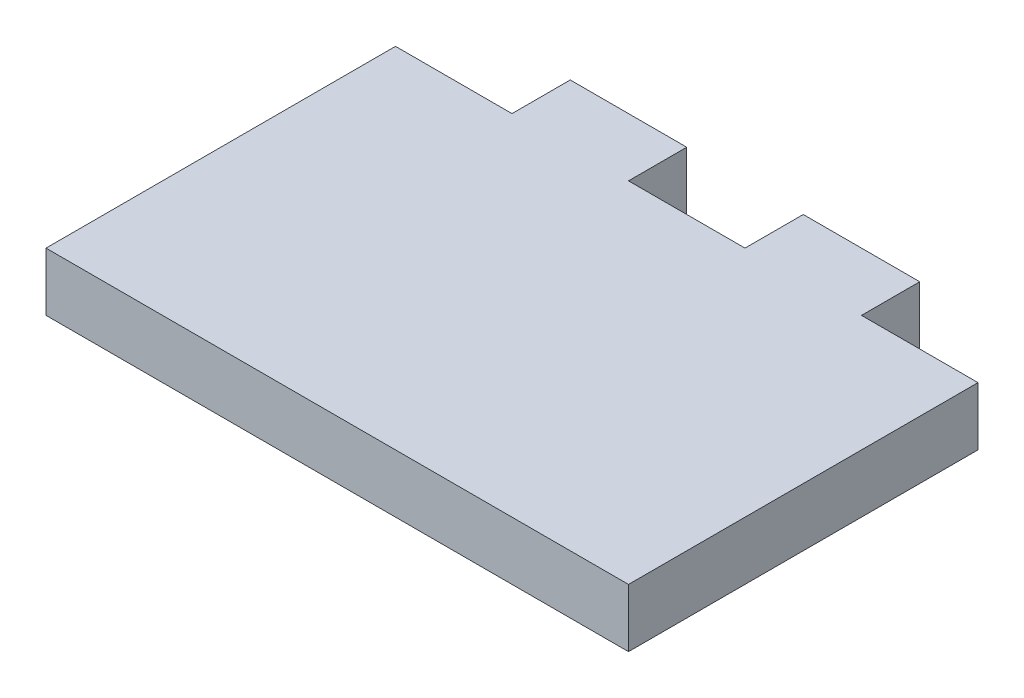
ISO-10303-21;
HEADER;
FILE_DESCRIPTION(('STEP AP214'),'2;1');
FILE_NAME('part.step','',(''),(''),'','','');
FILE_SCHEMA(('AUTOMOTIVE_DESIGN { 1 0 10303 214 1 1 1 1 }'));
ENDSEC;
DATA;
#1=APPLICATION_CONTEXT('core data for automotive mechanical design processes');
#2=APPLICATION_PROTOCOL_DEFINITION('international standard','automotive_design',2000,#1);
#3=PRODUCT_CONTEXT('',#1,'mechanical');
#4=PRODUCT('Part','Part','',(#3));
#5=PRODUCT_RELATED_PRODUCT_CATEGORY('part','',(#4));
#6=PRODUCT_DEFINITION_FORMATION('','',#4);
#7=PRODUCT_DEFINITION_CONTEXT('part definition',#1,'design');
#8=PRODUCT_DEFINITION('design','',#6,#7);
#9=PRODUCT_DEFINITION_SHAPE('','',#8);
#10=(LENGTH_UNIT() NAMED_UNIT(*) SI_UNIT(.MILLI.,.METRE.));
#11=(NAMED_UNIT(*) PLANE_ANGLE_UNIT() SI_UNIT($,.RADIAN.));
#12=(NAMED_UNIT(*) SI_UNIT($,.STERADIAN.) SOLID_ANGLE_UNIT());
#13=UNCERTAINTY_MEASURE_WITH_UNIT(LENGTH_MEASURE(1.E-05),#10,'distance_accuracy_value','');
#14=(GEOMETRIC_REPRESENTATION_CONTEXT(3) GLOBAL_UNCERTAINTY_ASSIGNED_CONTEXT((#13)) GLOBAL_UNIT_ASSIGNED_CONTEXT((#10,
#11,#12)) REPRESENTATION_CONTEXT('',''));
#15=CARTESIAN_POINT('',(0.,0.,0.));
#16=DIRECTION('',(0.,0.,1.));
#17=DIRECTION('',(1.,0.,0.));
#18=AXIS2_PLACEMENT_3D('',#15,#16,#17);
#19=CARTESIAN_POINT('',(0.,5.,0.));
#20=DIRECTION('',(-1.,0.,0.));
#21=DIRECTION('',(0.,0.,1.));
#22=AXIS2_PLACEMENT_3D('',#19,#20,#21);
#23=PLANE('',#22);
#24=DIRECTION('',(0.,0.,-1.));
#25=VECTOR('',#24,1.);
#26=CARTESIAN_POINT('',(0.,0.,0.));
#27=LINE('',#26,#25);
#28=CARTESIAN_POINT('',(0.,0.,0.));
#29=VERTEX_POINT('',#28);
#30=CARTESIAN_POINT('',(0.,0.,-30.));
#31=VERTEX_POINT('',#30);
#32=EDGE_CURVE('E156',#29,#31,#27,.T.);
#33=ORIENTED_EDGE('',*,*,#32,.T.);
#34=DIRECTION('',(0.,-1.,0.));
#35=VECTOR('',#34,1.);
#36=CARTESIAN_POINT('',(0.,5.,-30.));
#37=LINE('',#36,#35);
#38=CARTESIAN_POINT('',(0.,5.,-30.));
#39=VERTEX_POINT('',#38);
#40=EDGE_CURVE('E11',#39,#31,#37,.T.);
#41=ORIENTED_EDGE('',*,*,#40,.F.);
#42=DIRECTION('',(0.,0.,-1.));
#43=VECTOR('',#42,1.);
#44=CARTESIAN_POINT('',(0.,5.,0.));
#45=LINE('',#44,#43);
#46=CARTESIAN_POINT('',(0.,5.,0.));
#47=VERTEX_POINT('',#46);
#48=EDGE_CURVE('E178',#47,#39,#45,.T.);
#49=ORIENTED_EDGE('',*,*,#48,.F.);
#50=DIRECTION('',(0.,-1.,0.));
#51=VECTOR('',#50,1.);
#52=CARTESIAN_POINT('',(0.,5.,0.));
#53=LINE('',#52,#51);
#54=EDGE_CURVE('E152',#47,#29,#53,.T.);
#55=ORIENTED_EDGE('',*,*,#54,.T.);
#56=EDGE_LOOP('',(#33,#41,#49,#55));
#57=FACE_BOUND('',#56,.T.);
#58=ADVANCED_FACE('F36',(#57),#23,.F.);
#59=CARTESIAN_POINT('',(-10.,5.,-30.));
#60=DIRECTION('',(0.,0.,1.));
#61=DIRECTION('',(1.,0.,0.));
#62=AXIS2_PLACEMENT_3D('',#59,#60,#61);
#63=PLANE('',#62);
#64=DIRECTION('',(-1.,0.,0.));
#65=VECTOR('',#64,1.);
#66=CARTESIAN_POINT('',(-10.,0.,-30.));
#67=LINE('',#66,#65);
#68=CARTESIAN_POINT('',(-10.,0.,-30.));
#69=VERTEX_POINT('',#68);
#70=EDGE_CURVE('E159',#31,#69,#67,.T.);
#71=ORIENTED_EDGE('',*,*,#70,.T.);
#72=DIRECTION('',(0.,-1.,0.));
#73=VECTOR('',#72,1.);
#74=CARTESIAN_POINT('',(-10.,5.,-30.));
#75=LINE('',#74,#73);
#76=CARTESIAN_POINT('',(-10.,5.,-30.));
#77=VERTEX_POINT('',#76);
#78=EDGE_CURVE('E44',#77,#69,#75,.T.);
#79=ORIENTED_EDGE('',*,*,#78,.F.);
#80=DIRECTION('',(-1.,0.,0.));
#81=VECTOR('',#80,1.);
#82=CARTESIAN_POINT('',(-10.,5.,-30.));
#83=LINE('',#82,#81);
#84=EDGE_CURVE('E107',#39,#77,#83,.T.);
#85=ORIENTED_EDGE('',*,*,#84,.F.);
#86=ORIENTED_EDGE('',*,*,#40,.T.);
#87=EDGE_LOOP('',(#71,#79,#85,#86));
#88=FACE_BOUND('',#87,.T.);
#89=ADVANCED_FACE('F256',(#88),#63,.F.);
#90=CARTESIAN_POINT('',(-10.,5.,-35.));
#91=DIRECTION('',(-1.,0.,0.));
#92=DIRECTION('',(0.,0.,1.));
#93=AXIS2_PLACEMENT_3D('',#90,#91,#92);
#94=PLANE('',#93);
#95=DIRECTION('',(0.,0.,-1.));
#96=VECTOR('',#95,1.);
#97=CARTESIAN_POINT('',(-10.,0.,-35.));
#98=LINE('',#97,#96);
#99=CARTESIAN_POINT('',(-10.,0.,-35.));
#100=VERTEX_POINT('',#99);
#101=EDGE_CURVE('E161',#69,#100,#98,.T.);
#102=ORIENTED_EDGE('',*,*,#101,.T.);
#103=DIRECTION('',(0.,-1.,0.));
#104=VECTOR('',#103,1.);
#105=CARTESIAN_POINT('',(-10.,5.,-35.));
#106=LINE('',#105,#104);
#107=CARTESIAN_POINT('',(-10.,5.,-35.));
#108=VERTEX_POINT('',#107);
#109=EDGE_CURVE('E197',#108,#100,#106,.T.);
#110=ORIENTED_EDGE('',*,*,#109,.F.);
#111=DIRECTION('',(0.,0.,-1.));
#112=VECTOR('',#111,1.);
#113=CARTESIAN_POINT('',(-10.,5.,-35.));
#114=LINE('',#113,#112);
#115=EDGE_CURVE('E205',#77,#108,#114,.T.);
#116=ORIENTED_EDGE('',*,*,#115,.F.);
#117=ORIENTED_EDGE('',*,*,#78,.T.);
#118=EDGE_LOOP('',(#102,#110,#116,#117));
#119=FACE_BOUND('',#118,.T.);
#120=ADVANCED_FACE('F203',(#119),#94,.F.);
#121=CARTESIAN_POINT('',(-10.,5.,-35.));
#122=DIRECTION('',(0.,0.,1.));
#123=DIRECTION('',(1.,0.,0.));
#124=AXIS2_PLACEMENT_3D('',#121,#122,#123);
#125=PLANE('',#124);
#126=DIRECTION('',(-1.,0.,0.));
#127=VECTOR('',#126,1.);
#128=CARTESIAN_POINT('',(-10.,0.,-35.));
#129=LINE('',#128,#127);
#130=CARTESIAN_POINT('',(-20.,0.,-35.));
#131=VERTEX_POINT('',#130);
#132=EDGE_CURVE('E163',#100,#131,#129,.T.);
#133=ORIENTED_EDGE('',*,*,#132,.T.);
#134=DIRECTION('',(0.,-1.,0.));
#135=VECTOR('',#134,1.);
#136=CARTESIAN_POINT('',(-20.,5.,-35.));
#137=LINE('',#136,#135);
#138=CARTESIAN_POINT('',(-20.,5.,-35.));
#139=VERTEX_POINT('',#138);
#140=EDGE_CURVE('E194',#139,#131,#137,.T.);
#141=ORIENTED_EDGE('',*,*,#140,.F.);
#142=DIRECTION('',(-1.,0.,0.));
#143=VECTOR('',#142,1.);
#144=CARTESIAN_POINT('',(-10.,5.,-35.));
#145=LINE('',#144,#143);
#146=EDGE_CURVE('E223',#108,#139,#145,.T.);
#147=ORIENTED_EDGE('',*,*,#146,.F.);
#148=ORIENTED_EDGE('',*,*,#109,.T.);
#149=EDGE_LOOP('',(#133,#141,#147,#148));
#150=FACE_BOUND('',#149,.T.);
#151=ADVANCED_FACE('F214',(#150),#125,.F.);
#152=CARTESIAN_POINT('',(-20.,5.,-30.));
#153=DIRECTION('',(1.,0.,0.));
#154=DIRECTION('',(0.,0.,-1.));
#155=AXIS2_PLACEMENT_3D('',#152,#153,#154);
#156=PLANE('',#155);
#157=DIRECTION('',(0.,0.,1.));
#158=VECTOR('',#157,1.);
#159=CARTESIAN_POINT('',(-20.,0.,-30.));
#160=LINE('',#159,#158);
#161=CARTESIAN_POINT('',(-20.,0.,-30.));
#162=VERTEX_POINT('',#161);
#163=EDGE_CURVE('E165',#131,#162,#160,.T.);
#164=ORIENTED_EDGE('',*,*,#163,.T.);
#165=DIRECTION('',(0.,-1.,0.));
#166=VECTOR('',#165,1.);
#167=CARTESIAN_POINT('',(-20.,5.,-30.));
#168=LINE('',#167,#166);
#169=CARTESIAN_POINT('',(-20.,5.,-30.));
#170=VERTEX_POINT('',#169);
#171=EDGE_CURVE('E191',#170,#162,#168,.T.);
#172=ORIENTED_EDGE('',*,*,#171,.F.);
#173=DIRECTION('',(0.,0.,1.));
#174=VECTOR('',#173,1.);
#175=CARTESIAN_POINT('',(-20.,5.,-30.));
#176=LINE('',#175,#174);
#177=EDGE_CURVE('E220',#139,#170,#176,.T.);
#178=ORIENTED_EDGE('',*,*,#177,.F.);
#179=ORIENTED_EDGE('',*,*,#140,.T.);
#180=EDGE_LOOP('',(#164,#172,#178,#179));
#181=FACE_BOUND('',#180,.T.);
#182=ADVANCED_FACE('F218',(#181),#156,.F.);
#183=CARTESIAN_POINT('',(-30.,5.,-30.));
#184=DIRECTION('',(0.,0.,1.));
#185=DIRECTION('',(1.,0.,0.));
#186=AXIS2_PLACEMENT_3D('',#183,#184,#185);
#187=PLANE('',#186);
#188=DIRECTION('',(-1.,0.,0.));
#189=VECTOR('',#188,1.);
#190=CARTESIAN_POINT('',(-30.,0.,-30.));
#191=LINE('',#190,#189);
#192=CARTESIAN_POINT('',(-30.,0.,-30.));
#193=VERTEX_POINT('',#192);
#194=EDGE_CURVE('E167',#162,#193,#191,.T.);
#195=ORIENTED_EDGE('',*,*,#194,.T.);
#196=DIRECTION('',(0.,-1.,0.));
#197=VECTOR('',#196,1.);
#198=CARTESIAN_POINT('',(-30.,5.,-30.));
#199=LINE('',#198,#197);
#200=CARTESIAN_POINT('',(-30.,5.,-30.));
#201=VERTEX_POINT('',#200);
#202=EDGE_CURVE('E188',#201,#193,#199,.T.);
#203=ORIENTED_EDGE('',*,*,#202,.F.);
#204=DIRECTION('',(-1.,0.,0.));
#205=VECTOR('',#204,1.);
#206=CARTESIAN_POINT('',(-30.,5.,-30.));
#207=LINE('',#206,#205);
#208=EDGE_CURVE('E222',#170,#201,#207,.T.);
#209=ORIENTED_EDGE('',*,*,#208,.F.);
#210=ORIENTED_EDGE('',*,*,#171,.T.);
#211=EDGE_LOOP('',(#195,#203,#209,#210));
#212=FACE_BOUND('',#211,.T.);
#213=ADVANCED_FACE('F269',(#212),#187,.F.);
#214=CARTESIAN_POINT('',(-30.,5.,-35.));
#215=DIRECTION('',(-1.,0.,0.));
#216=DIRECTION('',(0.,0.,1.));
#217=AXIS2_PLACEMENT_3D('',#214,#215,#216);
#218=PLANE('',#217);
#219=DIRECTION('',(0.,0.,-1.));
#220=VECTOR('',#219,1.);
#221=CARTESIAN_POINT('',(-30.,0.,-35.));
#222=LINE('',#221,#220);
#223=CARTESIAN_POINT('',(-30.,0.,-35.));
#224=VERTEX_POINT('',#223);
#225=EDGE_CURVE('E169',#193,#224,#222,.T.);
#226=ORIENTED_EDGE('',*,*,#225,.T.);
#227=DIRECTION('',(0.,-1.,0.));
#228=VECTOR('',#227,1.);
#229=CARTESIAN_POINT('',(-30.,5.,-35.));
#230=LINE('',#229,#228);
#231=CARTESIAN_POINT('',(-30.,5.,-35.));
#232=VERTEX_POINT('',#231);
#233=EDGE_CURVE('E185',#232,#224,#230,.T.);
#234=ORIENTED_EDGE('',*,*,#233,.F.);
#235=DIRECTION('',(0.,0.,-1.));
#236=VECTOR('',#235,1.);
#237=CARTESIAN_POINT('',(-30.,5.,-35.));
#238=LINE('',#237,#236);
#239=EDGE_CURVE('E225',#201,#232,#238,.T.);
#240=ORIENTED_EDGE('',*,*,#239,.F.);
#241=ORIENTED_EDGE('',*,*,#202,.T.);
#242=EDGE_LOOP('',(#226,#234,#240,#241));
#243=FACE_BOUND('',#242,.T.);
#244=ADVANCED_FACE('F272',(#243),#218,.F.);
#245=CARTESIAN_POINT('',(-30.,5.,-35.));
#246=DIRECTION('',(0.,0.,1.));
#247=DIRECTION('',(1.,0.,0.));
#248=AXIS2_PLACEMENT_3D('',#245,#246,#247);
#249=PLANE('',#248);
#250=DIRECTION('',(-1.,0.,0.));
#251=VECTOR('',#250,1.);
#252=CARTESIAN_POINT('',(-30.,0.,-35.));
#253=LINE('',#252,#251);
#254=CARTESIAN_POINT('',(-40.,0.,-35.));
#255=VERTEX_POINT('',#254);
#256=EDGE_CURVE('E171',#224,#255,#253,.T.);
#257=ORIENTED_EDGE('',*,*,#256,.T.);
#258=DIRECTION('',(0.,-1.,0.));
#259=VECTOR('',#258,1.);
#260=CARTESIAN_POINT('',(-40.,5.,-35.));
#261=LINE('',#260,#259);
#262=CARTESIAN_POINT('',(-40.,5.,-35.));
#263=VERTEX_POINT('',#262);
#264=EDGE_CURVE('E182',#263,#255,#261,.T.);
#265=ORIENTED_EDGE('',*,*,#264,.F.);
#266=DIRECTION('',(-1.,0.,0.));
#267=VECTOR('',#266,1.);
#268=CARTESIAN_POINT('',(-30.,5.,-35.));
#269=LINE('',#268,#267);
#270=EDGE_CURVE('E231',#232,#263,#269,.T.);
#271=ORIENTED_EDGE('',*,*,#270,.F.);
#272=ORIENTED_EDGE('',*,*,#233,.T.);
#273=EDGE_LOOP('',(#257,#265,#271,#272));
#274=FACE_BOUND('',#273,.T.);
#275=ADVANCED_FACE('F237',(#274),#249,.F.);
#276=CARTESIAN_POINT('',(-40.,5.,-30.));
#277=DIRECTION('',(1.,0.,0.));
#278=DIRECTION('',(0.,0.,-1.));
#279=AXIS2_PLACEMENT_3D('',#276,#277,#278);
#280=PLANE('',#279);
#281=DIRECTION('',(0.,0.,1.));
#282=VECTOR('',#281,1.);
#283=CARTESIAN_POINT('',(-40.,0.,-30.));
#284=LINE('',#283,#282);
#285=CARTESIAN_POINT('',(-40.,0.,-30.));
#286=VERTEX_POINT('',#285);
#287=EDGE_CURVE('E173',#255,#286,#284,.T.);
#288=ORIENTED_EDGE('',*,*,#287,.T.);
#289=DIRECTION('',(0.,-1.,0.));
#290=VECTOR('',#289,1.);
#291=CARTESIAN_POINT('',(-40.,5.,-30.));
#292=LINE('',#291,#290);
#293=CARTESIAN_POINT('',(-40.,5.,-30.));
#294=VERTEX_POINT('',#293);
#295=EDGE_CURVE('E147',#294,#286,#292,.T.);
#296=ORIENTED_EDGE('',*,*,#295,.F.);
#297=DIRECTION('',(0.,0.,1.));
#298=VECTOR('',#297,1.);
#299=CARTESIAN_POINT('',(-40.,5.,-30.));
#300=LINE('',#299,#298);
#301=EDGE_CURVE('E138',#263,#294,#300,.T.);
#302=ORIENTED_EDGE('',*,*,#301,.F.);
#303=ORIENTED_EDGE('',*,*,#264,.T.);
#304=EDGE_LOOP('',(#288,#296,#302,#303));
#305=FACE_BOUND('',#304,.T.);
#306=ADVANCED_FACE('F241',(#305),#280,.F.);
#307=CARTESIAN_POINT('',(-50.,5.,-30.));
#308=DIRECTION('',(0.,0.,1.));
#309=DIRECTION('',(1.,0.,0.));
#310=AXIS2_PLACEMENT_3D('',#307,#308,#309);
#311=PLANE('',#310);
#312=DIRECTION('',(-1.,0.,0.));
#313=VECTOR('',#312,1.);
#314=CARTESIAN_POINT('',(-50.,0.,-30.));
#315=LINE('',#314,#313);
#316=CARTESIAN_POINT('',(-50.,0.,-30.));
#317=VERTEX_POINT('',#316);
#318=EDGE_CURVE('E146',#286,#317,#315,.T.);
#319=ORIENTED_EDGE('',*,*,#318,.T.);
#320=DIRECTION('',(0.,-1.,0.));
#321=VECTOR('',#320,1.);
#322=CARTESIAN_POINT('',(-50.,5.,-30.));
#323=LINE('',#322,#321);
#324=CARTESIAN_POINT('',(-50.,5.,-30.));
#325=VERTEX_POINT('',#324);
#326=EDGE_CURVE('E143',#325,#317,#323,.T.);
#327=ORIENTED_EDGE('',*,*,#326,.F.);
#328=DIRECTION('',(-1.,0.,0.));
#329=VECTOR('',#328,1.);
#330=CARTESIAN_POINT('',(-50.,5.,-30.));
#331=LINE('',#330,#329);
#332=EDGE_CURVE('E132',#294,#325,#331,.T.);
#333=ORIENTED_EDGE('',*,*,#332,.F.);
#334=ORIENTED_EDGE('',*,*,#295,.T.);
#335=EDGE_LOOP('',(#319,#327,#333,#334));
#336=FACE_BOUND('',#335,.T.);
#337=ADVANCED_FACE('F144',(#336),#311,.F.);
#338=CARTESIAN_POINT('',(-50.,5.,0.));
#339=DIRECTION('',(1.,0.,0.));
#340=DIRECTION('',(0.,0.,-1.));
#341=AXIS2_PLACEMENT_3D('',#338,#339,#340);
#342=PLANE('',#341);
#343=DIRECTION('',(0.,0.,1.));
#344=VECTOR('',#343,1.);
#345=CARTESIAN_POINT('',(-50.,0.,0.));
#346=LINE('',#345,#344);
#347=CARTESIAN_POINT('',(-50.,0.,0.));
#348=VERTEX_POINT('',#347);
#349=EDGE_CURVE('E93',#317,#348,#346,.T.);
#350=ORIENTED_EDGE('',*,*,#349,.T.);
#351=DIRECTION('',(0.,-1.,0.));
#352=VECTOR('',#351,1.);
#353=CARTESIAN_POINT('',(-50.,5.,0.));
#354=LINE('',#353,#352);
#355=CARTESIAN_POINT('',(-50.,5.,0.));
#356=VERTEX_POINT('',#355);
#357=EDGE_CURVE('E148',#356,#348,#354,.T.);
#358=ORIENTED_EDGE('',*,*,#357,.F.);
#359=DIRECTION('',(0.,0.,1.));
#360=VECTOR('',#359,1.);
#361=CARTESIAN_POINT('',(-50.,5.,0.));
#362=LINE('',#361,#360);
#363=EDGE_CURVE('E136',#325,#356,#362,.T.);
#364=ORIENTED_EDGE('',*,*,#363,.F.);
#365=ORIENTED_EDGE('',*,*,#326,.T.);
#366=EDGE_LOOP('',(#350,#358,#364,#365));
#367=FACE_BOUND('',#366,.T.);
#368=ADVANCED_FACE('F150',(#367),#342,.F.);
#369=CARTESIAN_POINT('',(0.,5.,0.));
#370=DIRECTION('',(0.,0.,-1.));
#371=DIRECTION('',(-1.,0.,0.));
#372=AXIS2_PLACEMENT_3D('',#369,#370,#371);
#373=PLANE('',#372);
#374=DIRECTION('',(1.,0.,0.));
#375=VECTOR('',#374,1.);
#376=CARTESIAN_POINT('',(0.,0.,0.));
#377=LINE('',#376,#375);
#378=EDGE_CURVE('E99',#348,#29,#377,.T.);
#379=ORIENTED_EDGE('',*,*,#378,.T.);
#380=ORIENTED_EDGE('',*,*,#54,.F.);
#381=DIRECTION('',(1.,0.,0.));
#382=VECTOR('',#381,1.);
#383=CARTESIAN_POINT('',(0.,5.,0.));
#384=LINE('',#383,#382);
#385=EDGE_CURVE('E52',#356,#47,#384,.T.);
#386=ORIENTED_EDGE('',*,*,#385,.F.);
#387=ORIENTED_EDGE('',*,*,#357,.T.);
#388=EDGE_LOOP('',(#379,#380,#386,#387));
#389=FACE_BOUND('',#388,.T.);
#390=ADVANCED_FACE('F245',(#389),#373,.F.);
#391=CARTESIAN_POINT('',(0.,5.,0.));
#392=DIRECTION('',(0.,-1.,0.));
#393=DIRECTION('',(0.,0.,-1.));
#394=AXIS2_PLACEMENT_3D('',#391,#392,#393);
#395=PLANE('',#394);
#396=ORIENTED_EDGE('',*,*,#48,.T.);
#397=ORIENTED_EDGE('',*,*,#84,.T.);
#398=ORIENTED_EDGE('',*,*,#115,.T.);
#399=ORIENTED_EDGE('',*,*,#146,.T.);
#400=ORIENTED_EDGE('',*,*,#177,.T.);
#401=ORIENTED_EDGE('',*,*,#208,.T.);
#402=ORIENTED_EDGE('',*,*,#239,.T.);
#403=ORIENTED_EDGE('',*,*,#270,.T.);
#404=ORIENTED_EDGE('',*,*,#301,.T.);
#405=ORIENTED_EDGE('',*,*,#332,.T.);
#406=ORIENTED_EDGE('',*,*,#363,.T.);
#407=ORIENTED_EDGE('',*,*,#385,.T.);
#408=EDGE_LOOP('',(#396,#397,#398,#399,#400,#401,#402,#403,#404,#405,#406,#407));
#409=FACE_BOUND('',#408,.T.);
#410=ADVANCED_FACE('F134',(#409),#395,.F.);
#411=CARTESIAN_POINT('',(0.,0.,0.));
#412=DIRECTION('',(0.,-1.,0.));
#413=DIRECTION('',(0.,0.,-1.));
#414=AXIS2_PLACEMENT_3D('',#411,#412,#413);
#415=PLANE('',#414);
#416=ORIENTED_EDGE('',*,*,#32,.F.);
#417=ORIENTED_EDGE('',*,*,#378,.F.);
#418=ORIENTED_EDGE('',*,*,#349,.F.);
#419=ORIENTED_EDGE('',*,*,#318,.F.);
#420=ORIENTED_EDGE('',*,*,#287,.F.);
#421=ORIENTED_EDGE('',*,*,#256,.F.);
#422=ORIENTED_EDGE('',*,*,#225,.F.);
#423=ORIENTED_EDGE('',*,*,#194,.F.);
#424=ORIENTED_EDGE('',*,*,#163,.F.);
#425=ORIENTED_EDGE('',*,*,#132,.F.);
#426=ORIENTED_EDGE('',*,*,#101,.F.);
#427=ORIENTED_EDGE('',*,*,#70,.F.);
#428=EDGE_LOOP('',(#416,#417,#418,#419,#420,#421,#422,#423,#424,#425,#426,#427));
#429=FACE_BOUND('',#428,.T.);
#430=ADVANCED_FACE('F209',(#429),#415,.T.);
#431=CLOSED_SHELL('',(#58,#89,#120,#151,#182,#213,#244,#275,#306,#337,#368,#390,#410,#430));
#432=MANIFOLD_SOLID_BREP('B2',#431);
#433=ADVANCED_BREP_SHAPE_REPRESENTATION('',(#18,#432),#14);
#434=SHAPE_DEFINITION_REPRESENTATION(#9,#433);
ENDSEC;
END-ISO-10303-21;
